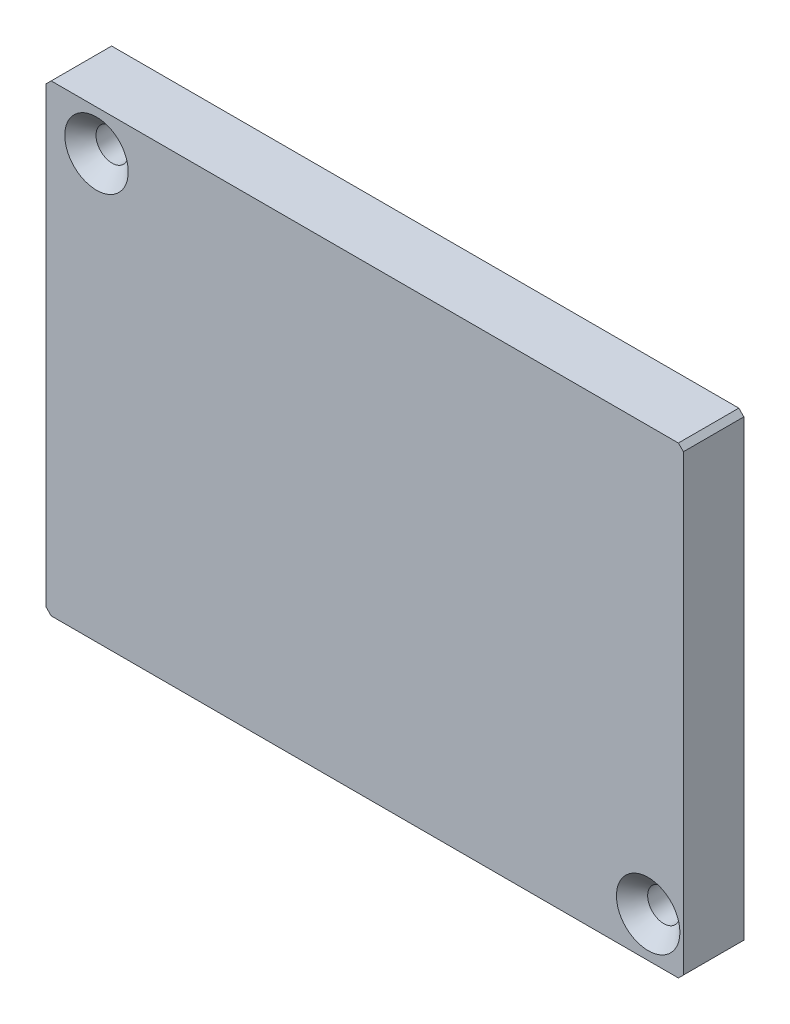
ISO-10303-21;
HEADER;
FILE_DESCRIPTION(('STEP AP214'),'2;1');
FILE_NAME('part.step','',(''),(''),'','','');
FILE_SCHEMA(('AUTOMOTIVE_DESIGN { 1 0 10303 214 1 1 1 1 }'));
ENDSEC;
DATA;
#1=APPLICATION_CONTEXT('core data for automotive mechanical design processes');
#2=APPLICATION_PROTOCOL_DEFINITION('international standard','automotive_design',2000,#1);
#3=PRODUCT_CONTEXT('',#1,'mechanical');
#4=PRODUCT('Part','Part','',(#3));
#5=PRODUCT_RELATED_PRODUCT_CATEGORY('part','',(#4));
#6=PRODUCT_DEFINITION_FORMATION('','',#4);
#7=PRODUCT_DEFINITION_CONTEXT('part definition',#1,'design');
#8=PRODUCT_DEFINITION('design','',#6,#7);
#9=PRODUCT_DEFINITION_SHAPE('','',#8);
#10=(LENGTH_UNIT() NAMED_UNIT(*) SI_UNIT(.MILLI.,.METRE.));
#11=(NAMED_UNIT(*) PLANE_ANGLE_UNIT() SI_UNIT($,.RADIAN.));
#12=(NAMED_UNIT(*) SI_UNIT($,.STERADIAN.) SOLID_ANGLE_UNIT());
#13=UNCERTAINTY_MEASURE_WITH_UNIT(LENGTH_MEASURE(1.E-05),#10,'distance_accuracy_value','');
#14=(GEOMETRIC_REPRESENTATION_CONTEXT(3) GLOBAL_UNCERTAINTY_ASSIGNED_CONTEXT((#13)) GLOBAL_UNIT_ASSIGNED_CONTEXT((#10,
#11,#12)) REPRESENTATION_CONTEXT('',''));
#15=CARTESIAN_POINT('',(0.,0.,0.));
#16=DIRECTION('',(0.,0.,1.));
#17=DIRECTION('',(1.,0.,0.));
#18=AXIS2_PLACEMENT_3D('',#15,#16,#17);
#19=CARTESIAN_POINT('',(-326.379657854734,23.,6.));
#20=DIRECTION('',(0.707106781186552,-0.707106781186542,0.));
#21=DIRECTION('',(0.707106781186543,0.707106781186553,0.));
#22=AXIS2_PLACEMENT_3D('',#19,#20,#21);
#23=PLANE('',#22);
#24=DIRECTION('',(-0.707106781186542,-0.707106781186552,0.));
#25=VECTOR('',#24,1.);
#26=CARTESIAN_POINT('',(-326.379657854734,23.,0.));
#27=LINE('',#26,#25);
#28=CARTESIAN_POINT('',(-326.379657854734,23.,0.));
#29=VERTEX_POINT('',#28);
#30=CARTESIAN_POINT('',(-326.879657854734,22.5,0.));
#31=VERTEX_POINT('',#30);
#32=EDGE_CURVE('E143',#29,#31,#27,.T.);
#33=ORIENTED_EDGE('',*,*,#32,.T.);
#34=DIRECTION('',(0.,0.,-1.));
#35=VECTOR('',#34,1.);
#36=CARTESIAN_POINT('',(-326.879657854734,22.5,6.));
#37=LINE('',#36,#35);
#38=CARTESIAN_POINT('',(-326.879657854734,22.5,6.));
#39=VERTEX_POINT('',#38);
#40=EDGE_CURVE('E11',#39,#31,#37,.T.);
#41=ORIENTED_EDGE('',*,*,#40,.F.);
#42=DIRECTION('',(-0.707106781186542,-0.707106781186552,0.));
#43=VECTOR('',#42,1.);
#44=CARTESIAN_POINT('',(-326.379657854734,23.,6.));
#45=LINE('',#44,#43);
#46=CARTESIAN_POINT('',(-326.379657854734,23.,6.));
#47=VERTEX_POINT('',#46);
#48=EDGE_CURVE('E166',#47,#39,#45,.T.);
#49=ORIENTED_EDGE('',*,*,#48,.F.);
#50=DIRECTION('',(0.,0.,-1.));
#51=VECTOR('',#50,1.);
#52=CARTESIAN_POINT('',(-326.379657854734,23.,6.));
#53=LINE('',#52,#51);
#54=EDGE_CURVE('E139',#47,#29,#53,.T.);
#55=ORIENTED_EDGE('',*,*,#54,.T.);
#56=EDGE_LOOP('',(#33,#41,#49,#55));
#57=FACE_BOUND('',#56,.T.);
#58=ADVANCED_FACE('F39',(#57),#23,.F.);
#59=CARTESIAN_POINT('',(-326.879657854734,22.5,6.));
#60=DIRECTION('',(1.,0.,0.));
#61=DIRECTION('',(0.,0.,-1.));
#62=AXIS2_PLACEMENT_3D('',#59,#60,#61);
#63=PLANE('',#62);
#64=DIRECTION('',(0.,-1.,0.));
#65=VECTOR('',#64,1.);
#66=CARTESIAN_POINT('',(-326.879657854734,22.5,0.));
#67=LINE('',#66,#65);
#68=CARTESIAN_POINT('',(-326.879657854734,-22.5,0.));
#69=VERTEX_POINT('',#68);
#70=EDGE_CURVE('E147',#31,#69,#67,.T.);
#71=ORIENTED_EDGE('',*,*,#70,.T.);
#72=DIRECTION('',(0.,0.,-1.));
#73=VECTOR('',#72,1.);
#74=CARTESIAN_POINT('',(-326.879657854734,-22.5,6.));
#75=LINE('',#74,#73);
#76=CARTESIAN_POINT('',(-326.879657854734,-22.5,6.));
#77=VERTEX_POINT('',#76);
#78=EDGE_CURVE('E48',#77,#69,#75,.T.);
#79=ORIENTED_EDGE('',*,*,#78,.F.);
#80=DIRECTION('',(0.,-1.,0.));
#81=VECTOR('',#80,1.);
#82=CARTESIAN_POINT('',(-326.879657854734,22.5,6.));
#83=LINE('',#82,#81);
#84=EDGE_CURVE('E100',#39,#77,#83,.T.);
#85=ORIENTED_EDGE('',*,*,#84,.F.);
#86=ORIENTED_EDGE('',*,*,#40,.T.);
#87=EDGE_LOOP('',(#71,#79,#85,#86));
#88=FACE_BOUND('',#87,.T.);
#89=ADVANCED_FACE('F307',(#88),#63,.F.);
#90=CARTESIAN_POINT('',(-326.879657854734,-22.5,6.));
#91=DIRECTION('',(0.707106781186557,0.707106781186538,0.));
#92=DIRECTION('',(-0.707106781186538,0.707106781186557,0.));
#93=AXIS2_PLACEMENT_3D('',#90,#91,#92);
#94=PLANE('',#93);
#95=DIRECTION('',(0.707106781186538,-0.707106781186557,0.));
#96=VECTOR('',#95,1.);
#97=CARTESIAN_POINT('',(-326.879657854734,-22.5,0.));
#98=LINE('',#97,#96);
#99=CARTESIAN_POINT('',(-326.379657854734,-23.,0.));
#100=VERTEX_POINT('',#99);
#101=EDGE_CURVE('E151',#69,#100,#98,.T.);
#102=ORIENTED_EDGE('',*,*,#101,.T.);
#103=DIRECTION('',(0.,0.,-1.));
#104=VECTOR('',#103,1.);
#105=CARTESIAN_POINT('',(-326.379657854734,-23.,6.));
#106=LINE('',#105,#104);
#107=CARTESIAN_POINT('',(-326.379657854734,-23.,6.));
#108=VERTEX_POINT('',#107);
#109=EDGE_CURVE('E177',#108,#100,#106,.T.);
#110=ORIENTED_EDGE('',*,*,#109,.F.);
#111=DIRECTION('',(0.707106781186538,-0.707106781186557,0.));
#112=VECTOR('',#111,1.);
#113=CARTESIAN_POINT('',(-326.879657854734,-22.5,6.));
#114=LINE('',#113,#112);
#115=EDGE_CURVE('E187',#77,#108,#114,.T.);
#116=ORIENTED_EDGE('',*,*,#115,.F.);
#117=ORIENTED_EDGE('',*,*,#78,.T.);
#118=EDGE_LOOP('',(#102,#110,#116,#117));
#119=FACE_BOUND('',#118,.T.);
#120=ADVANCED_FACE('F185',(#119),#94,.F.);
#121=CARTESIAN_POINT('',(-326.379657854734,-23.,6.));
#122=DIRECTION('',(0.,1.,0.));
#123=DIRECTION('',(0.,0.,1.));
#124=AXIS2_PLACEMENT_3D('',#121,#122,#123);
#125=PLANE('',#124);
#126=DIRECTION('',(1.,0.,0.));
#127=VECTOR('',#126,1.);
#128=CARTESIAN_POINT('',(-326.379657854734,-23.,0.));
#129=LINE('',#128,#127);
#130=CARTESIAN_POINT('',(-264.109857854734,-23.,0.));
#131=VERTEX_POINT('',#130);
#132=EDGE_CURVE('E154',#100,#131,#129,.T.);
#133=ORIENTED_EDGE('',*,*,#132,.T.);
#134=DIRECTION('',(0.,0.,-1.));
#135=VECTOR('',#134,1.);
#136=CARTESIAN_POINT('',(-264.109857854734,-23.,6.));
#137=LINE('',#136,#135);
#138=CARTESIAN_POINT('',(-264.109857854734,-23.,6.));
#139=VERTEX_POINT('',#138);
#140=EDGE_CURVE('E173',#139,#131,#137,.T.);
#141=ORIENTED_EDGE('',*,*,#140,.F.);
#142=DIRECTION('',(1.,0.,0.));
#143=VECTOR('',#142,1.);
#144=CARTESIAN_POINT('',(-326.379657854734,-23.,6.));
#145=LINE('',#144,#143);
#146=EDGE_CURVE('E200',#108,#139,#145,.T.);
#147=ORIENTED_EDGE('',*,*,#146,.F.);
#148=ORIENTED_EDGE('',*,*,#109,.T.);
#149=EDGE_LOOP('',(#133,#141,#147,#148));
#150=FACE_BOUND('',#149,.T.);
#151=ADVANCED_FACE('F195',(#150),#125,.F.);
#152=CARTESIAN_POINT('',(-264.109857854734,-23.,6.));
#153=DIRECTION('',(-0.707106781186552,0.707106781186542,0.));
#154=DIRECTION('',(-0.707106781186543,-0.707106781186553,0.));
#155=AXIS2_PLACEMENT_3D('',#152,#153,#154);
#156=PLANE('',#155);
#157=DIRECTION('',(0.707106781186542,0.707106781186552,0.));
#158=VECTOR('',#157,1.);
#159=CARTESIAN_POINT('',(-264.109857854734,-23.,0.));
#160=LINE('',#159,#158);
#161=CARTESIAN_POINT('',(-263.609857854734,-22.5,0.));
#162=VERTEX_POINT('',#161);
#163=EDGE_CURVE('E157',#131,#162,#160,.T.);
#164=ORIENTED_EDGE('',*,*,#163,.T.);
#165=DIRECTION('',(0.,0.,-1.));
#166=VECTOR('',#165,1.);
#167=CARTESIAN_POINT('',(-263.609857854734,-22.5,6.));
#168=LINE('',#167,#166);
#169=CARTESIAN_POINT('',(-263.609857854734,-22.5,6.));
#170=VERTEX_POINT('',#169);
#171=EDGE_CURVE('E132',#170,#162,#168,.T.);
#172=ORIENTED_EDGE('',*,*,#171,.F.);
#173=DIRECTION('',(0.707106781186542,0.707106781186552,0.));
#174=VECTOR('',#173,1.);
#175=CARTESIAN_POINT('',(-264.109857854734,-23.,6.));
#176=LINE('',#175,#174);
#177=EDGE_CURVE('E121',#139,#170,#176,.T.);
#178=ORIENTED_EDGE('',*,*,#177,.F.);
#179=ORIENTED_EDGE('',*,*,#140,.T.);
#180=EDGE_LOOP('',(#164,#172,#178,#179));
#181=FACE_BOUND('',#180,.T.);
#182=ADVANCED_FACE('F198',(#181),#156,.F.);
#183=CARTESIAN_POINT('',(-263.609857854734,-22.5,6.));
#184=DIRECTION('',(-1.,0.,0.));
#185=DIRECTION('',(0.,-1.,0.));
#186=AXIS2_PLACEMENT_3D('',#183,#184,#185);
#187=PLANE('',#186);
#188=DIRECTION('',(0.,1.,0.));
#189=VECTOR('',#188,1.);
#190=CARTESIAN_POINT('',(-263.609857854734,-22.5,0.));
#191=LINE('',#190,#189);
#192=CARTESIAN_POINT('',(-263.609857854734,22.5,0.));
#193=VERTEX_POINT('',#192);
#194=EDGE_CURVE('E130',#162,#193,#191,.T.);
#195=ORIENTED_EDGE('',*,*,#194,.T.);
#196=DIRECTION('',(0.,0.,-1.));
#197=VECTOR('',#196,1.);
#198=CARTESIAN_POINT('',(-263.609857854734,22.5,6.));
#199=LINE('',#198,#197);
#200=CARTESIAN_POINT('',(-263.609857854734,22.5,6.));
#201=VERTEX_POINT('',#200);
#202=EDGE_CURVE('E127',#201,#193,#199,.T.);
#203=ORIENTED_EDGE('',*,*,#202,.F.);
#204=DIRECTION('',(0.,1.,0.));
#205=VECTOR('',#204,1.);
#206=CARTESIAN_POINT('',(-263.609857854734,-22.5,6.));
#207=LINE('',#206,#205);
#208=EDGE_CURVE('E115',#170,#201,#207,.T.);
#209=ORIENTED_EDGE('',*,*,#208,.F.);
#210=ORIENTED_EDGE('',*,*,#171,.T.);
#211=EDGE_LOOP('',(#195,#203,#209,#210));
#212=FACE_BOUND('',#211,.T.);
#213=ADVANCED_FACE('F128',(#212),#187,.F.);
#214=CARTESIAN_POINT('',(-263.609857854734,22.5,6.));
#215=DIRECTION('',(-0.707106781186557,-0.707106781186538,0.));
#216=DIRECTION('',(0.707106781186538,-0.707106781186557,0.));
#217=AXIS2_PLACEMENT_3D('',#214,#215,#216);
#218=PLANE('',#217);
#219=DIRECTION('',(-0.707106781186538,0.707106781186557,0.));
#220=VECTOR('',#219,1.);
#221=CARTESIAN_POINT('',(-263.609857854734,22.5,0.));
#222=LINE('',#221,#220);
#223=CARTESIAN_POINT('',(-264.109857854734,23.,0.));
#224=VERTEX_POINT('',#223);
#225=EDGE_CURVE('E86',#193,#224,#222,.T.);
#226=ORIENTED_EDGE('',*,*,#225,.T.);
#227=DIRECTION('',(0.,0.,-1.));
#228=VECTOR('',#227,1.);
#229=CARTESIAN_POINT('',(-264.109857854734,23.,6.));
#230=LINE('',#229,#228);
#231=CARTESIAN_POINT('',(-264.109857854734,23.,6.));
#232=VERTEX_POINT('',#231);
#233=EDGE_CURVE('E133',#232,#224,#230,.T.);
#234=ORIENTED_EDGE('',*,*,#233,.F.);
#235=DIRECTION('',(-0.707106781186538,0.707106781186557,0.));
#236=VECTOR('',#235,1.);
#237=CARTESIAN_POINT('',(-263.609857854734,22.5,6.));
#238=LINE('',#237,#236);
#239=EDGE_CURVE('E119',#201,#232,#238,.T.);
#240=ORIENTED_EDGE('',*,*,#239,.F.);
#241=ORIENTED_EDGE('',*,*,#202,.T.);
#242=EDGE_LOOP('',(#226,#234,#240,#241));
#243=FACE_BOUND('',#242,.T.);
#244=ADVANCED_FACE('F135',(#243),#218,.F.);
#245=CARTESIAN_POINT('',(-264.109857854734,23.,6.));
#246=DIRECTION('',(0.,-1.,0.));
#247=DIRECTION('',(0.,0.,-1.));
#248=AXIS2_PLACEMENT_3D('',#245,#246,#247);
#249=PLANE('',#248);
#250=DIRECTION('',(-1.,0.,0.));
#251=VECTOR('',#250,1.);
#252=CARTESIAN_POINT('',(-264.109857854734,23.,0.));
#253=LINE('',#252,#251);
#254=EDGE_CURVE('E92',#224,#29,#253,.T.);
#255=ORIENTED_EDGE('',*,*,#254,.T.);
#256=ORIENTED_EDGE('',*,*,#54,.F.);
#257=DIRECTION('',(-1.,0.,0.));
#258=VECTOR('',#257,1.);
#259=CARTESIAN_POINT('',(-264.109857854734,23.,6.));
#260=LINE('',#259,#258);
#261=EDGE_CURVE('E56',#232,#47,#260,.T.);
#262=ORIENTED_EDGE('',*,*,#261,.F.);
#263=ORIENTED_EDGE('',*,*,#233,.T.);
#264=EDGE_LOOP('',(#255,#256,#262,#263));
#265=FACE_BOUND('',#264,.T.);
#266=ADVANCED_FACE('F286',(#265),#249,.F.);
#267=CARTESIAN_POINT('',(0.,0.,6.));
#268=DIRECTION('',(0.,0.,1.));
#269=DIRECTION('',(1.,0.,0.));
#270=AXIS2_PLACEMENT_3D('',#267,#268,#269);
#271=PLANE('',#270);
#272=CARTESIAN_POINT('',(-321.879657854734,19.,6.));
#273=DIRECTION('',(0.,0.,1.));
#274=DIRECTION('',(1.,0.,0.));
#275=AXIS2_PLACEMENT_3D('',#272,#273,#274);
#276=CIRCLE('',#275,3.14999999999999);
#277=CARTESIAN_POINT('',(-318.729657854734,19.,6.));
#278=VERTEX_POINT('',#277);
#279=EDGE_CURVE('E277',#278,#278,#276,.T.);
#280=ORIENTED_EDGE('',*,*,#279,.F.);
#281=EDGE_LOOP('',(#280));
#282=FACE_BOUND('',#281,.T.);
#283=CARTESIAN_POINT('',(-267.109857854734,-19.,6.));
#284=DIRECTION('',(0.,0.,1.));
#285=DIRECTION('',(1.,0.,0.));
#286=AXIS2_PLACEMENT_3D('',#283,#284,#285);
#287=CIRCLE('',#286,3.14999999999999);
#288=CARTESIAN_POINT('',(-263.959857854734,-19.,6.));
#289=VERTEX_POINT('',#288);
#290=EDGE_CURVE('E265',#289,#289,#287,.T.);
#291=ORIENTED_EDGE('',*,*,#290,.F.);
#292=EDGE_LOOP('',(#291));
#293=FACE_BOUND('',#292,.T.);
#294=ORIENTED_EDGE('',*,*,#48,.T.);
#295=ORIENTED_EDGE('',*,*,#84,.T.);
#296=ORIENTED_EDGE('',*,*,#115,.T.);
#297=ORIENTED_EDGE('',*,*,#146,.T.);
#298=ORIENTED_EDGE('',*,*,#177,.T.);
#299=ORIENTED_EDGE('',*,*,#208,.T.);
#300=ORIENTED_EDGE('',*,*,#239,.T.);
#301=ORIENTED_EDGE('',*,*,#261,.T.);
#302=EDGE_LOOP('',(#294,#295,#296,#297,#298,#299,#300,#301));
#303=FACE_BOUND('',#302,.T.);
#304=ADVANCED_FACE('F117',(#282,#293,#303),#271,.T.);
#305=CARTESIAN_POINT('',(0.,0.,0.));
#306=DIRECTION('',(0.,0.,1.));
#307=DIRECTION('',(1.,0.,0.));
#308=AXIS2_PLACEMENT_3D('',#305,#306,#307);
#309=PLANE('',#308);
#310=CARTESIAN_POINT('',(-321.879657854734,19.,0.));
#311=DIRECTION('',(0.,0.,1.));
#312=DIRECTION('',(1.,0.,0.));
#313=AXIS2_PLACEMENT_3D('',#310,#311,#312);
#314=CIRCLE('',#313,1.59999999999999);
#315=CARTESIAN_POINT('',(-320.279657854734,19.,0.));
#316=VERTEX_POINT('',#315);
#317=EDGE_CURVE('E269',#316,#316,#314,.T.);
#318=ORIENTED_EDGE('',*,*,#317,.T.);
#319=EDGE_LOOP('',(#318));
#320=FACE_BOUND('',#319,.T.);
#321=CARTESIAN_POINT('',(-267.109857854734,-19.,0.));
#322=DIRECTION('',(0.,0.,1.));
#323=DIRECTION('',(1.,0.,0.));
#324=AXIS2_PLACEMENT_3D('',#321,#322,#323);
#325=CIRCLE('',#324,1.59999999999999);
#326=CARTESIAN_POINT('',(-265.509857854734,-19.,0.));
#327=VERTEX_POINT('',#326);
#328=EDGE_CURVE('E257',#327,#327,#325,.T.);
#329=ORIENTED_EDGE('',*,*,#328,.T.);
#330=EDGE_LOOP('',(#329));
#331=FACE_BOUND('',#330,.T.);
#332=CARTESIAN_POINT('',(-298.609857854734,-13.1125,0.));
#333=DIRECTION('',(0.,0.,-1.));
#334=DIRECTION('',(-1.,0.,0.));
#335=AXIS2_PLACEMENT_3D('',#332,#333,#334);
#336=CIRCLE('',#335,3.19999999999998);
#337=CARTESIAN_POINT('',(-301.809857854734,-13.1125,0.));
#338=VERTEX_POINT('',#337);
#339=EDGE_CURVE('E253',#338,#338,#336,.T.);
#340=ORIENTED_EDGE('',*,*,#339,.F.);
#341=EDGE_LOOP('',(#340));
#342=FACE_BOUND('',#341,.T.);
#343=CARTESIAN_POINT('',(-276.609857854734,8.88750000000002,0.));
#344=DIRECTION('',(0.,0.,-1.));
#345=DIRECTION('',(-1.,0.,0.));
#346=AXIS2_PLACEMENT_3D('',#343,#344,#345);
#347=CIRCLE('',#346,3.19999999999998);
#348=CARTESIAN_POINT('',(-279.809857854734,8.88750000000002,0.));
#349=VERTEX_POINT('',#348);
#350=EDGE_CURVE('E241',#349,#349,#347,.T.);
#351=ORIENTED_EDGE('',*,*,#350,.F.);
#352=EDGE_LOOP('',(#351));
#353=FACE_BOUND('',#352,.T.);
#354=CARTESIAN_POINT('',(-267.109857854734,19.,0.));
#355=DIRECTION('',(0.,0.,-1.));
#356=DIRECTION('',(-1.,0.,0.));
#357=AXIS2_PLACEMENT_3D('',#354,#355,#356);
#358=CIRCLE('',#357,3.19999999999998);
#359=CARTESIAN_POINT('',(-270.309857854734,19.,0.));
#360=VERTEX_POINT('',#359);
#361=EDGE_CURVE('E229',#360,#360,#358,.T.);
#362=ORIENTED_EDGE('',*,*,#361,.F.);
#363=EDGE_LOOP('',(#362));
#364=FACE_BOUND('',#363,.T.);
#365=CARTESIAN_POINT('',(-321.879657854734,-19.,0.));
#366=DIRECTION('',(0.,0.,-1.));
#367=DIRECTION('',(-1.,0.,0.));
#368=AXIS2_PLACEMENT_3D('',#365,#366,#367);
#369=CIRCLE('',#368,3.19999999999998);
#370=CARTESIAN_POINT('',(-325.079657854734,-19.,0.));
#371=VERTEX_POINT('',#370);
#372=EDGE_CURVE('E217',#371,#371,#369,.T.);
#373=ORIENTED_EDGE('',*,*,#372,.F.);
#374=EDGE_LOOP('',(#373));
#375=FACE_BOUND('',#374,.T.);
#376=ORIENTED_EDGE('',*,*,#32,.F.);
#377=ORIENTED_EDGE('',*,*,#254,.F.);
#378=ORIENTED_EDGE('',*,*,#225,.F.);
#379=ORIENTED_EDGE('',*,*,#194,.F.);
#380=ORIENTED_EDGE('',*,*,#163,.F.);
#381=ORIENTED_EDGE('',*,*,#132,.F.);
#382=ORIENTED_EDGE('',*,*,#101,.F.);
#383=ORIENTED_EDGE('',*,*,#70,.F.);
#384=EDGE_LOOP('',(#376,#377,#378,#379,#380,#381,#382,#383));
#385=FACE_BOUND('',#384,.T.);
#386=ADVANCED_FACE('F191',(#320,#331,#342,#353,#364,#375,#385),#309,.F.);
#387=CARTESIAN_POINT('',(-321.879657854734,-19.,2.));
#388=DIRECTION('',(0.,0.,-1.));
#389=DIRECTION('',(-1.,0.,0.));
#390=AXIS2_PLACEMENT_3D('',#387,#388,#389);
#391=CONICAL_SURFACE('',#390,3.14999999999999,1.02974425867665);
#392=CARTESIAN_POINT('',(-321.879657854734,-19.,3.89271094993682));
#393=VERTEX_POINT('',#392);
#394=VERTEX_LOOP('',#393);
#395=FACE_BOUND('',#394,.T.);
#396=CARTESIAN_POINT('',(-321.879657854734,-19.,2.));
#397=DIRECTION('',(0.,0.,-1.));
#398=DIRECTION('',(-1.,0.,0.));
#399=AXIS2_PLACEMENT_3D('',#396,#397,#398);
#400=CIRCLE('',#399,3.14999999999999);
#401=CARTESIAN_POINT('',(-325.029657854734,-19.,2.));
#402=VERTEX_POINT('',#401);
#403=EDGE_CURVE('E148',#402,#402,#400,.T.);
#404=ORIENTED_EDGE('',*,*,#403,.T.);
#405=EDGE_LOOP('',(#404));
#406=FACE_BOUND('',#405,.T.);
#407=ADVANCED_FACE('F359',(#395,#406),#391,.F.);
#408=CARTESIAN_POINT('',(-321.879657854734,-19.,0.));
#409=DIRECTION('',(0.,0.,-1.));
#410=DIRECTION('',(-1.,0.,0.));
#411=AXIS2_PLACEMENT_3D('',#408,#409,#410);
#412=CYLINDRICAL_SURFACE('',#411,3.14999999999999);
#413=ORIENTED_EDGE('',*,*,#403,.F.);
#414=EDGE_LOOP('',(#413));
#415=FACE_BOUND('',#414,.T.);
#416=CARTESIAN_POINT('',(-321.879657854734,-19.,0.049999999999998));
#417=DIRECTION('',(0.,0.,-1.));
#418=DIRECTION('',(-1.,0.,0.));
#419=AXIS2_PLACEMENT_3D('',#416,#417,#418);
#420=CIRCLE('',#419,3.14999999999999);
#421=CARTESIAN_POINT('',(-325.029657854734,-19.,0.049999999999998));
#422=VERTEX_POINT('',#421);
#423=EDGE_CURVE('E213',#422,#422,#420,.T.);
#424=ORIENTED_EDGE('',*,*,#423,.T.);
#425=EDGE_LOOP('',(#424));
#426=FACE_BOUND('',#425,.T.);
#427=ADVANCED_FACE('F364',(#415,#426),#412,.F.);
#428=CARTESIAN_POINT('',(-321.879657854734,-19.,0.));
#429=DIRECTION('',(0.,0.,-1.));
#430=DIRECTION('',(-1.,0.,0.));
#431=AXIS2_PLACEMENT_3D('',#428,#429,#430);
#432=CONICAL_SURFACE('',#431,3.19999999999998,0.785398163397414);
#433=ORIENTED_EDGE('',*,*,#423,.F.);
#434=EDGE_LOOP('',(#433));
#435=FACE_BOUND('',#434,.T.);
#436=ORIENTED_EDGE('',*,*,#372,.T.);
#437=EDGE_LOOP('',(#436));
#438=FACE_BOUND('',#437,.T.);
#439=ADVANCED_FACE('F376',(#435,#438),#432,.F.);
#440=CARTESIAN_POINT('',(-267.109857854734,19.,2.));
#441=DIRECTION('',(0.,0.,-1.));
#442=DIRECTION('',(-1.,0.,0.));
#443=AXIS2_PLACEMENT_3D('',#440,#441,#442);
#444=CONICAL_SURFACE('',#443,3.14999999999999,1.02974425867665);
#445=CARTESIAN_POINT('',(-267.109857854734,19.,3.89271094993682));
#446=VERTEX_POINT('',#445);
#447=VERTEX_LOOP('',#446);
#448=FACE_BOUND('',#447,.T.);
#449=CARTESIAN_POINT('',(-267.109857854734,19.,2.));
#450=DIRECTION('',(0.,0.,-1.));
#451=DIRECTION('',(-1.,0.,0.));
#452=AXIS2_PLACEMENT_3D('',#449,#450,#451);
#453=CIRCLE('',#452,3.14999999999999);
#454=CARTESIAN_POINT('',(-270.259857854734,19.,2.));
#455=VERTEX_POINT('',#454);
#456=EDGE_CURVE('E221',#455,#455,#453,.T.);
#457=ORIENTED_EDGE('',*,*,#456,.T.);
#458=EDGE_LOOP('',(#457));
#459=FACE_BOUND('',#458,.T.);
#460=ADVANCED_FACE('F386',(#448,#459),#444,.F.);
#461=CARTESIAN_POINT('',(-267.109857854734,19.,0.));
#462=DIRECTION('',(0.,0.,-1.));
#463=DIRECTION('',(-1.,0.,0.));
#464=AXIS2_PLACEMENT_3D('',#461,#462,#463);
#465=CYLINDRICAL_SURFACE('',#464,3.14999999999999);
#466=ORIENTED_EDGE('',*,*,#456,.F.);
#467=EDGE_LOOP('',(#466));
#468=FACE_BOUND('',#467,.T.);
#469=CARTESIAN_POINT('',(-267.109857854734,19.,0.049999999999998));
#470=DIRECTION('',(0.,0.,-1.));
#471=DIRECTION('',(-1.,0.,0.));
#472=AXIS2_PLACEMENT_3D('',#469,#470,#471);
#473=CIRCLE('',#472,3.14999999999999);
#474=CARTESIAN_POINT('',(-270.259857854734,19.,0.049999999999998));
#475=VERTEX_POINT('',#474);
#476=EDGE_CURVE('E225',#475,#475,#473,.T.);
#477=ORIENTED_EDGE('',*,*,#476,.T.);
#478=EDGE_LOOP('',(#477));
#479=FACE_BOUND('',#478,.T.);
#480=ADVANCED_FACE('F396',(#468,#479),#465,.F.);
#481=CARTESIAN_POINT('',(-267.109857854734,19.,0.));
#482=DIRECTION('',(0.,0.,-1.));
#483=DIRECTION('',(-1.,0.,0.));
#484=AXIS2_PLACEMENT_3D('',#481,#482,#483);
#485=CONICAL_SURFACE('',#484,3.19999999999998,0.785398163397414);
#486=ORIENTED_EDGE('',*,*,#476,.F.);
#487=EDGE_LOOP('',(#486));
#488=FACE_BOUND('',#487,.T.);
#489=ORIENTED_EDGE('',*,*,#361,.T.);
#490=EDGE_LOOP('',(#489));
#491=FACE_BOUND('',#490,.T.);
#492=ADVANCED_FACE('F406',(#488,#491),#485,.F.);
#493=CARTESIAN_POINT('',(-276.609857854734,8.88750000000002,2.));
#494=DIRECTION('',(0.,0.,-1.));
#495=DIRECTION('',(-1.,0.,0.));
#496=AXIS2_PLACEMENT_3D('',#493,#494,#495);
#497=CONICAL_SURFACE('',#496,3.14999999999999,1.02974425867665);
#498=CARTESIAN_POINT('',(-276.609857854734,8.88750000000002,3.89271094993682));
#499=VERTEX_POINT('',#498);
#500=VERTEX_LOOP('',#499);
#501=FACE_BOUND('',#500,.T.);
#502=CARTESIAN_POINT('',(-276.609857854734,8.88750000000002,2.));
#503=DIRECTION('',(0.,0.,-1.));
#504=DIRECTION('',(-1.,0.,0.));
#505=AXIS2_PLACEMENT_3D('',#502,#503,#504);
#506=CIRCLE('',#505,3.14999999999999);
#507=CARTESIAN_POINT('',(-279.759857854734,8.88750000000002,2.));
#508=VERTEX_POINT('',#507);
#509=EDGE_CURVE('E233',#508,#508,#506,.T.);
#510=ORIENTED_EDGE('',*,*,#509,.T.);
#511=EDGE_LOOP('',(#510));
#512=FACE_BOUND('',#511,.T.);
#513=ADVANCED_FACE('F416',(#501,#512),#497,.F.);
#514=CARTESIAN_POINT('',(-276.609857854734,8.88750000000002,0.));
#515=DIRECTION('',(0.,0.,-1.));
#516=DIRECTION('',(-1.,0.,0.));
#517=AXIS2_PLACEMENT_3D('',#514,#515,#516);
#518=CYLINDRICAL_SURFACE('',#517,3.14999999999999);
#519=ORIENTED_EDGE('',*,*,#509,.F.);
#520=EDGE_LOOP('',(#519));
#521=FACE_BOUND('',#520,.T.);
#522=CARTESIAN_POINT('',(-276.609857854734,8.88750000000002,0.049999999999998));
#523=DIRECTION('',(0.,0.,-1.));
#524=DIRECTION('',(-1.,0.,0.));
#525=AXIS2_PLACEMENT_3D('',#522,#523,#524);
#526=CIRCLE('',#525,3.14999999999999);
#527=CARTESIAN_POINT('',(-279.759857854734,8.88750000000002,0.049999999999998));
#528=VERTEX_POINT('',#527);
#529=EDGE_CURVE('E237',#528,#528,#526,.T.);
#530=ORIENTED_EDGE('',*,*,#529,.T.);
#531=EDGE_LOOP('',(#530));
#532=FACE_BOUND('',#531,.T.);
#533=ADVANCED_FACE('F426',(#521,#532),#518,.F.);
#534=CARTESIAN_POINT('',(-276.609857854734,8.88750000000002,0.));
#535=DIRECTION('',(0.,0.,-1.));
#536=DIRECTION('',(-1.,0.,0.));
#537=AXIS2_PLACEMENT_3D('',#534,#535,#536);
#538=CONICAL_SURFACE('',#537,3.19999999999998,0.785398163397414);
#539=ORIENTED_EDGE('',*,*,#529,.F.);
#540=EDGE_LOOP('',(#539));
#541=FACE_BOUND('',#540,.T.);
#542=ORIENTED_EDGE('',*,*,#350,.T.);
#543=EDGE_LOOP('',(#542));
#544=FACE_BOUND('',#543,.T.);
#545=ADVANCED_FACE('F436',(#541,#544),#538,.F.);
#546=CARTESIAN_POINT('',(-298.609857854734,-13.1125,2.));
#547=DIRECTION('',(0.,0.,-1.));
#548=DIRECTION('',(-1.,0.,0.));
#549=AXIS2_PLACEMENT_3D('',#546,#547,#548);
#550=CONICAL_SURFACE('',#549,3.14999999999999,1.02974425867665);
#551=CARTESIAN_POINT('',(-298.609857854734,-13.1125,3.89271094993682));
#552=VERTEX_POINT('',#551);
#553=VERTEX_LOOP('',#552);
#554=FACE_BOUND('',#553,.T.);
#555=CARTESIAN_POINT('',(-298.609857854734,-13.1125,2.));
#556=DIRECTION('',(0.,0.,-1.));
#557=DIRECTION('',(-1.,0.,0.));
#558=AXIS2_PLACEMENT_3D('',#555,#556,#557);
#559=CIRCLE('',#558,3.14999999999999);
#560=CARTESIAN_POINT('',(-301.759857854734,-13.1125,2.));
#561=VERTEX_POINT('',#560);
#562=EDGE_CURVE('E245',#561,#561,#559,.T.);
#563=ORIENTED_EDGE('',*,*,#562,.T.);
#564=EDGE_LOOP('',(#563));
#565=FACE_BOUND('',#564,.T.);
#566=ADVANCED_FACE('F446',(#554,#565),#550,.F.);
#567=CARTESIAN_POINT('',(-298.609857854734,-13.1125,0.));
#568=DIRECTION('',(0.,0.,-1.));
#569=DIRECTION('',(-1.,0.,0.));
#570=AXIS2_PLACEMENT_3D('',#567,#568,#569);
#571=CYLINDRICAL_SURFACE('',#570,3.14999999999999);
#572=ORIENTED_EDGE('',*,*,#562,.F.);
#573=EDGE_LOOP('',(#572));
#574=FACE_BOUND('',#573,.T.);
#575=CARTESIAN_POINT('',(-298.609857854734,-13.1125,0.049999999999998));
#576=DIRECTION('',(0.,0.,-1.));
#577=DIRECTION('',(-1.,0.,0.));
#578=AXIS2_PLACEMENT_3D('',#575,#576,#577);
#579=CIRCLE('',#578,3.14999999999999);
#580=CARTESIAN_POINT('',(-301.759857854734,-13.1125,0.049999999999998));
#581=VERTEX_POINT('',#580);
#582=EDGE_CURVE('E249',#581,#581,#579,.T.);
#583=ORIENTED_EDGE('',*,*,#582,.T.);
#584=EDGE_LOOP('',(#583));
#585=FACE_BOUND('',#584,.T.);
#586=ADVANCED_FACE('F456',(#574,#585),#571,.F.);
#587=CARTESIAN_POINT('',(-298.609857854734,-13.1125,0.));
#588=DIRECTION('',(0.,0.,-1.));
#589=DIRECTION('',(-1.,0.,0.));
#590=AXIS2_PLACEMENT_3D('',#587,#588,#589);
#591=CONICAL_SURFACE('',#590,3.19999999999998,0.785398163397414);
#592=ORIENTED_EDGE('',*,*,#582,.F.);
#593=EDGE_LOOP('',(#592));
#594=FACE_BOUND('',#593,.T.);
#595=ORIENTED_EDGE('',*,*,#339,.T.);
#596=EDGE_LOOP('',(#595));
#597=FACE_BOUND('',#596,.T.);
#598=ADVANCED_FACE('F302',(#594,#597),#591,.F.);
#599=CARTESIAN_POINT('',(-267.109857854734,-19.,6.));
#600=DIRECTION('',(0.,0.,1.));
#601=DIRECTION('',(1.,0.,0.));
#602=AXIS2_PLACEMENT_3D('',#599,#600,#601);
#603=CYLINDRICAL_SURFACE('',#602,1.59999999999999);
#604=ORIENTED_EDGE('',*,*,#328,.F.);
#605=EDGE_LOOP('',(#604));
#606=FACE_BOUND('',#605,.T.);
#607=CARTESIAN_POINT('',(-267.109857854734,-19.,4.45));
#608=DIRECTION('',(0.,0.,1.));
#609=DIRECTION('',(1.,0.,0.));
#610=AXIS2_PLACEMENT_3D('',#607,#608,#609);
#611=CIRCLE('',#610,1.59999999999999);
#612=CARTESIAN_POINT('',(-265.509857854734,-19.,4.45));
#613=VERTEX_POINT('',#612);
#614=EDGE_CURVE('E261',#613,#613,#611,.T.);
#615=ORIENTED_EDGE('',*,*,#614,.T.);
#616=EDGE_LOOP('',(#615));
#617=FACE_BOUND('',#616,.T.);
#618=ADVANCED_FACE('F293',(#606,#617),#603,.F.);
#619=CARTESIAN_POINT('',(-267.109857854734,-19.,6.));
#620=DIRECTION('',(0.,0.,1.));
#621=DIRECTION('',(1.,0.,0.));
#622=AXIS2_PLACEMENT_3D('',#619,#620,#621);
#623=CONICAL_SURFACE('',#622,3.14999999999999,0.785398163397448);
#624=ORIENTED_EDGE('',*,*,#614,.F.);
#625=EDGE_LOOP('',(#624));
#626=FACE_BOUND('',#625,.T.);
#627=ORIENTED_EDGE('',*,*,#290,.T.);
#628=EDGE_LOOP('',(#627));
#629=FACE_BOUND('',#628,.T.);
#630=ADVANCED_FACE('F290',(#626,#629),#623,.F.);
#631=CARTESIAN_POINT('',(-321.879657854734,19.,6.));
#632=DIRECTION('',(0.,0.,1.));
#633=DIRECTION('',(1.,0.,0.));
#634=AXIS2_PLACEMENT_3D('',#631,#632,#633);
#635=CYLINDRICAL_SURFACE('',#634,1.59999999999999);
#636=ORIENTED_EDGE('',*,*,#317,.F.);
#637=EDGE_LOOP('',(#636));
#638=FACE_BOUND('',#637,.T.);
#639=CARTESIAN_POINT('',(-321.879657854734,19.,4.45));
#640=DIRECTION('',(0.,0.,1.));
#641=DIRECTION('',(1.,0.,0.));
#642=AXIS2_PLACEMENT_3D('',#639,#640,#641);
#643=CIRCLE('',#642,1.59999999999999);
#644=CARTESIAN_POINT('',(-320.279657854734,19.,4.45));
#645=VERTEX_POINT('',#644);
#646=EDGE_CURVE('E273',#645,#645,#643,.T.);
#647=ORIENTED_EDGE('',*,*,#646,.T.);
#648=EDGE_LOOP('',(#647));
#649=FACE_BOUND('',#648,.T.);
#650=ADVANCED_FACE('F292',(#638,#649),#635,.F.);
#651=CARTESIAN_POINT('',(-321.879657854734,19.,6.));
#652=DIRECTION('',(0.,0.,1.));
#653=DIRECTION('',(1.,0.,0.));
#654=AXIS2_PLACEMENT_3D('',#651,#652,#653);
#655=CONICAL_SURFACE('',#654,3.14999999999999,0.785398163397448);
#656=ORIENTED_EDGE('',*,*,#646,.F.);
#657=EDGE_LOOP('',(#656));
#658=FACE_BOUND('',#657,.T.);
#659=ORIENTED_EDGE('',*,*,#279,.T.);
#660=EDGE_LOOP('',(#659));
#661=FACE_BOUND('',#660,.T.);
#662=ADVANCED_FACE('F282',(#658,#661),#655,.F.);
#663=CLOSED_SHELL('',(#58,#89,#120,#151,#182,#213,#244,#266,#304,#386,#407,#427,#439,#460,#480,
#492,#513,#533,#545,#566,#586,#598,#618,#630,#650,#662));
#664=MANIFOLD_SOLID_BREP('B2',#663);
#665=ADVANCED_BREP_SHAPE_REPRESENTATION('',(#18,#664),#14);
#666=SHAPE_DEFINITION_REPRESENTATION(#9,#665);
ENDSEC;
END-ISO-10303-21;
